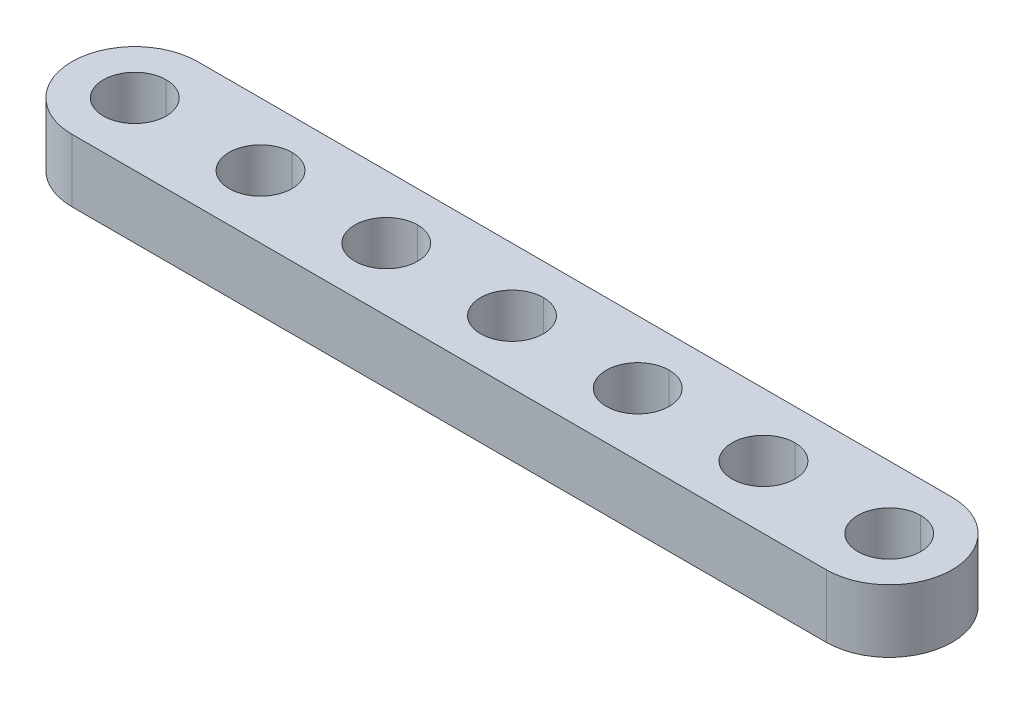
ISO-10303-21;
HEADER;
FILE_DESCRIPTION(('STEP AP214'),'2;1');
FILE_NAME('part.step','',(''),(''),'','','');
FILE_SCHEMA(('AUTOMOTIVE_DESIGN { 1 0 10303 214 1 1 1 1 }'));
ENDSEC;
DATA;
#1=APPLICATION_CONTEXT('core data for automotive mechanical design processes');
#2=APPLICATION_PROTOCOL_DEFINITION('international standard','automotive_design',2000,#1);
#3=PRODUCT_CONTEXT('',#1,'mechanical');
#4=PRODUCT('Part','Part','',(#3));
#5=PRODUCT_RELATED_PRODUCT_CATEGORY('part','',(#4));
#6=PRODUCT_DEFINITION_FORMATION('','',#4);
#7=PRODUCT_DEFINITION_CONTEXT('part definition',#1,'design');
#8=PRODUCT_DEFINITION('design','',#6,#7);
#9=PRODUCT_DEFINITION_SHAPE('','',#8);
#10=(LENGTH_UNIT() NAMED_UNIT(*) SI_UNIT(.MILLI.,.METRE.));
#11=(NAMED_UNIT(*) PLANE_ANGLE_UNIT() SI_UNIT($,.RADIAN.));
#12=(NAMED_UNIT(*) SI_UNIT($,.STERADIAN.) SOLID_ANGLE_UNIT());
#13=UNCERTAINTY_MEASURE_WITH_UNIT(LENGTH_MEASURE(1.E-05),#10,'distance_accuracy_value','');
#14=(GEOMETRIC_REPRESENTATION_CONTEXT(3) GLOBAL_UNCERTAINTY_ASSIGNED_CONTEXT((#13)) GLOBAL_UNIT_ASSIGNED_CONTEXT((#10,
#11,#12)) REPRESENTATION_CONTEXT('',''));
#15=CARTESIAN_POINT('',(0.,0.,0.));
#16=DIRECTION('',(0.,0.,1.));
#17=DIRECTION('',(1.,0.,0.));
#18=AXIS2_PLACEMENT_3D('',#15,#16,#17);
#19=CARTESIAN_POINT('',(24.,4.,0.));
#20=DIRECTION('',(0.,1.,0.));
#21=DIRECTION('',(0.,0.,1.));
#22=AXIS2_PLACEMENT_3D('',#19,#20,#21);
#23=CYLINDRICAL_SURFACE('',#22,2.);
#24=DIRECTION('',(0.,1.,0.));
#25=VECTOR('',#24,1.);
#26=CARTESIAN_POINT('',(24.,4.,-2.));
#27=LINE('',#26,#25);
#28=CARTESIAN_POINT('',(24.,0.,-2.));
#29=VERTEX_POINT('',#28);
#30=CARTESIAN_POINT('',(24.,4.,-2.));
#31=VERTEX_POINT('',#30);
#32=EDGE_CURVE('E207',#29,#31,#27,.T.);
#33=ORIENTED_EDGE('',*,*,#32,.F.);
#34=CARTESIAN_POINT('',(24.,0.,0.));
#35=DIRECTION('',(0.,1.,0.));
#36=DIRECTION('',(0.,0.,1.));
#37=AXIS2_PLACEMENT_3D('',#34,#35,#36);
#38=CIRCLE('',#37,2.);
#39=CARTESIAN_POINT('',(24.,0.,2.));
#40=VERTEX_POINT('',#39);
#41=EDGE_CURVE('E344',#40,#29,#38,.T.);
#42=ORIENTED_EDGE('',*,*,#41,.F.);
#43=DIRECTION('',(0.,1.,0.));
#44=VECTOR('',#43,1.);
#45=CARTESIAN_POINT('',(24.,4.,2.));
#46=LINE('',#45,#44);
#47=CARTESIAN_POINT('',(24.,4.,2.));
#48=VERTEX_POINT('',#47);
#49=EDGE_CURVE('E223',#40,#48,#46,.T.);
#50=ORIENTED_EDGE('',*,*,#49,.T.);
#51=CARTESIAN_POINT('',(24.,4.,0.));
#52=DIRECTION('',(0.,1.,0.));
#53=DIRECTION('',(0.,0.,1.));
#54=AXIS2_PLACEMENT_3D('',#51,#52,#53);
#55=CIRCLE('',#54,2.);
#56=EDGE_CURVE('E182',#48,#31,#55,.T.);
#57=ORIENTED_EDGE('',*,*,#56,.T.);
#58=EDGE_LOOP('',(#33,#42,#50,#57));
#59=FACE_BOUND('',#58,.T.);
#60=ADVANCED_FACE('F14',(#59),#23,.F.);
#61=CARTESIAN_POINT('',(16.,4.,0.));
#62=DIRECTION('',(0.,1.,0.));
#63=DIRECTION('',(0.,0.,1.));
#64=AXIS2_PLACEMENT_3D('',#61,#62,#63);
#65=CYLINDRICAL_SURFACE('',#64,2.);
#66=DIRECTION('',(0.,1.,0.));
#67=VECTOR('',#66,1.);
#68=CARTESIAN_POINT('',(16.,4.,-2.));
#69=LINE('',#68,#67);
#70=CARTESIAN_POINT('',(16.,0.,-2.));
#71=VERTEX_POINT('',#70);
#72=CARTESIAN_POINT('',(16.,4.,-2.));
#73=VERTEX_POINT('',#72);
#74=EDGE_CURVE('E195',#71,#73,#69,.T.);
#75=ORIENTED_EDGE('',*,*,#74,.F.);
#76=CARTESIAN_POINT('',(16.,0.,0.));
#77=DIRECTION('',(0.,1.,0.));
#78=DIRECTION('',(0.,0.,1.));
#79=AXIS2_PLACEMENT_3D('',#76,#77,#78);
#80=CIRCLE('',#79,2.);
#81=CARTESIAN_POINT('',(16.,0.,2.));
#82=VERTEX_POINT('',#81);
#83=EDGE_CURVE('E187',#82,#71,#80,.T.);
#84=ORIENTED_EDGE('',*,*,#83,.F.);
#85=DIRECTION('',(0.,1.,0.));
#86=VECTOR('',#85,1.);
#87=CARTESIAN_POINT('',(16.,4.,2.));
#88=LINE('',#87,#86);
#89=CARTESIAN_POINT('',(16.,4.,2.));
#90=VERTEX_POINT('',#89);
#91=EDGE_CURVE('E185',#82,#90,#88,.T.);
#92=ORIENTED_EDGE('',*,*,#91,.T.);
#93=CARTESIAN_POINT('',(16.,4.,0.));
#94=DIRECTION('',(0.,1.,0.));
#95=DIRECTION('',(0.,0.,1.));
#96=AXIS2_PLACEMENT_3D('',#93,#94,#95);
#97=CIRCLE('',#96,2.);
#98=EDGE_CURVE('E171',#90,#73,#97,.T.);
#99=ORIENTED_EDGE('',*,*,#98,.T.);
#100=EDGE_LOOP('',(#75,#84,#92,#99));
#101=FACE_BOUND('',#100,.T.);
#102=ADVANCED_FACE('F186',(#101),#65,.F.);
#103=CARTESIAN_POINT('',(8.,4.,0.));
#104=DIRECTION('',(0.,1.,0.));
#105=DIRECTION('',(0.,0.,1.));
#106=AXIS2_PLACEMENT_3D('',#103,#104,#105);
#107=CYLINDRICAL_SURFACE('',#106,2.);
#108=DIRECTION('',(0.,1.,0.));
#109=VECTOR('',#108,1.);
#110=CARTESIAN_POINT('',(8.,4.,-2.));
#111=LINE('',#110,#109);
#112=CARTESIAN_POINT('',(8.,0.,-2.));
#113=VERTEX_POINT('',#112);
#114=CARTESIAN_POINT('',(8.,4.,-2.));
#115=VERTEX_POINT('',#114);
#116=EDGE_CURVE('E211',#113,#115,#111,.T.);
#117=ORIENTED_EDGE('',*,*,#116,.F.);
#118=CARTESIAN_POINT('',(8.,0.,0.));
#119=DIRECTION('',(0.,1.,0.));
#120=DIRECTION('',(0.,0.,1.));
#121=AXIS2_PLACEMENT_3D('',#118,#119,#120);
#122=CIRCLE('',#121,2.);
#123=CARTESIAN_POINT('',(8.,0.,2.));
#124=VERTEX_POINT('',#123);
#125=EDGE_CURVE('E215',#124,#113,#122,.T.);
#126=ORIENTED_EDGE('',*,*,#125,.F.);
#127=DIRECTION('',(0.,1.,0.));
#128=VECTOR('',#127,1.);
#129=CARTESIAN_POINT('',(8.,4.,2.));
#130=LINE('',#129,#128);
#131=CARTESIAN_POINT('',(8.,4.,2.));
#132=VERTEX_POINT('',#131);
#133=EDGE_CURVE('E302',#124,#132,#130,.T.);
#134=ORIENTED_EDGE('',*,*,#133,.T.);
#135=CARTESIAN_POINT('',(8.,4.,0.));
#136=DIRECTION('',(0.,1.,0.));
#137=DIRECTION('',(0.,0.,1.));
#138=AXIS2_PLACEMENT_3D('',#135,#136,#137);
#139=CIRCLE('',#138,2.);
#140=EDGE_CURVE('E181',#132,#115,#139,.T.);
#141=ORIENTED_EDGE('',*,*,#140,.T.);
#142=EDGE_LOOP('',(#117,#126,#134,#141));
#143=FACE_BOUND('',#142,.T.);
#144=ADVANCED_FACE('F463',(#143),#107,.F.);
#145=CARTESIAN_POINT('',(0.,4.,0.));
#146=DIRECTION('',(0.,1.,0.));
#147=DIRECTION('',(0.,0.,1.));
#148=AXIS2_PLACEMENT_3D('',#145,#146,#147);
#149=CYLINDRICAL_SURFACE('',#148,2.);
#150=DIRECTION('',(0.,1.,0.));
#151=VECTOR('',#150,1.);
#152=CARTESIAN_POINT('',(0.,4.,-2.));
#153=LINE('',#152,#151);
#154=CARTESIAN_POINT('',(0.,0.,-2.));
#155=VERTEX_POINT('',#154);
#156=CARTESIAN_POINT('',(0.,4.,-2.));
#157=VERTEX_POINT('',#156);
#158=EDGE_CURVE('E411',#155,#157,#153,.T.);
#159=ORIENTED_EDGE('',*,*,#158,.F.);
#160=CARTESIAN_POINT('',(0.,0.,0.));
#161=DIRECTION('',(0.,1.,0.));
#162=DIRECTION('',(0.,0.,1.));
#163=AXIS2_PLACEMENT_3D('',#160,#161,#162);
#164=CIRCLE('',#163,2.);
#165=CARTESIAN_POINT('',(0.,0.,2.));
#166=VERTEX_POINT('',#165);
#167=EDGE_CURVE('E217',#166,#155,#164,.T.);
#168=ORIENTED_EDGE('',*,*,#167,.F.);
#169=DIRECTION('',(0.,1.,0.));
#170=VECTOR('',#169,1.);
#171=CARTESIAN_POINT('',(0.,4.,2.));
#172=LINE('',#171,#170);
#173=CARTESIAN_POINT('',(0.,4.,2.));
#174=VERTEX_POINT('',#173);
#175=EDGE_CURVE('E265',#166,#174,#172,.T.);
#176=ORIENTED_EDGE('',*,*,#175,.T.);
#177=CARTESIAN_POINT('',(0.,4.,0.));
#178=DIRECTION('',(0.,1.,0.));
#179=DIRECTION('',(0.,0.,1.));
#180=AXIS2_PLACEMENT_3D('',#177,#178,#179);
#181=CIRCLE('',#180,2.);
#182=EDGE_CURVE('E342',#174,#157,#181,.T.);
#183=ORIENTED_EDGE('',*,*,#182,.T.);
#184=EDGE_LOOP('',(#159,#168,#176,#183));
#185=FACE_BOUND('',#184,.T.);
#186=ADVANCED_FACE('F446',(#185),#149,.F.);
#187=CARTESIAN_POINT('',(-8.,4.,0.));
#188=DIRECTION('',(0.,1.,0.));
#189=DIRECTION('',(0.,0.,1.));
#190=AXIS2_PLACEMENT_3D('',#187,#188,#189);
#191=CYLINDRICAL_SURFACE('',#190,2.);
#192=DIRECTION('',(0.,1.,0.));
#193=VECTOR('',#192,1.);
#194=CARTESIAN_POINT('',(-8.,4.,-2.));
#195=LINE('',#194,#193);
#196=CARTESIAN_POINT('',(-8.,0.,-2.));
#197=VERTEX_POINT('',#196);
#198=CARTESIAN_POINT('',(-8.,4.,-2.));
#199=VERTEX_POINT('',#198);
#200=EDGE_CURVE('E243',#197,#199,#195,.T.);
#201=ORIENTED_EDGE('',*,*,#200,.F.);
#202=CARTESIAN_POINT('',(-8.,0.,0.));
#203=DIRECTION('',(0.,1.,0.));
#204=DIRECTION('',(0.,0.,1.));
#205=AXIS2_PLACEMENT_3D('',#202,#203,#204);
#206=CIRCLE('',#205,2.);
#207=CARTESIAN_POINT('',(-8.,0.,2.));
#208=VERTEX_POINT('',#207);
#209=EDGE_CURVE('E225',#208,#197,#206,.T.);
#210=ORIENTED_EDGE('',*,*,#209,.F.);
#211=DIRECTION('',(0.,1.,0.));
#212=VECTOR('',#211,1.);
#213=CARTESIAN_POINT('',(-8.,4.,2.));
#214=LINE('',#213,#212);
#215=CARTESIAN_POINT('',(-8.,4.,2.));
#216=VERTEX_POINT('',#215);
#217=EDGE_CURVE('E226',#208,#216,#214,.T.);
#218=ORIENTED_EDGE('',*,*,#217,.T.);
#219=CARTESIAN_POINT('',(-8.,4.,0.));
#220=DIRECTION('',(0.,1.,0.));
#221=DIRECTION('',(0.,0.,1.));
#222=AXIS2_PLACEMENT_3D('',#219,#220,#221);
#223=CIRCLE('',#222,2.);
#224=EDGE_CURVE('E723',#216,#199,#223,.T.);
#225=ORIENTED_EDGE('',*,*,#224,.T.);
#226=EDGE_LOOP('',(#201,#210,#218,#225));
#227=FACE_BOUND('',#226,.T.);
#228=ADVANCED_FACE('F441',(#227),#191,.F.);
#229=CARTESIAN_POINT('',(-16.,4.,0.));
#230=DIRECTION('',(0.,1.,0.));
#231=DIRECTION('',(0.,0.,1.));
#232=AXIS2_PLACEMENT_3D('',#229,#230,#231);
#233=CYLINDRICAL_SURFACE('',#232,2.);
#234=DIRECTION('',(0.,1.,0.));
#235=VECTOR('',#234,1.);
#236=CARTESIAN_POINT('',(-16.,4.,-2.));
#237=LINE('',#236,#235);
#238=CARTESIAN_POINT('',(-16.,0.,-2.));
#239=VERTEX_POINT('',#238);
#240=CARTESIAN_POINT('',(-16.,4.,-2.));
#241=VERTEX_POINT('',#240);
#242=EDGE_CURVE('E240',#239,#241,#237,.T.);
#243=ORIENTED_EDGE('',*,*,#242,.F.);
#244=CARTESIAN_POINT('',(-16.,0.,0.));
#245=DIRECTION('',(0.,1.,0.));
#246=DIRECTION('',(0.,0.,1.));
#247=AXIS2_PLACEMENT_3D('',#244,#245,#246);
#248=CIRCLE('',#247,2.);
#249=CARTESIAN_POINT('',(-16.,0.,2.));
#250=VERTEX_POINT('',#249);
#251=EDGE_CURVE('E24',#250,#239,#248,.T.);
#252=ORIENTED_EDGE('',*,*,#251,.F.);
#253=DIRECTION('',(0.,1.,0.));
#254=VECTOR('',#253,1.);
#255=CARTESIAN_POINT('',(-16.,4.,2.));
#256=LINE('',#255,#254);
#257=CARTESIAN_POINT('',(-16.,4.,2.));
#258=VERTEX_POINT('',#257);
#259=EDGE_CURVE('E269',#250,#258,#256,.T.);
#260=ORIENTED_EDGE('',*,*,#259,.T.);
#261=CARTESIAN_POINT('',(-16.,4.,0.));
#262=DIRECTION('',(0.,1.,0.));
#263=DIRECTION('',(0.,0.,1.));
#264=AXIS2_PLACEMENT_3D('',#261,#262,#263);
#265=CIRCLE('',#264,2.);
#266=EDGE_CURVE('E128',#258,#241,#265,.T.);
#267=ORIENTED_EDGE('',*,*,#266,.T.);
#268=EDGE_LOOP('',(#243,#252,#260,#267));
#269=FACE_BOUND('',#268,.T.);
#270=ADVANCED_FACE('F445',(#269),#233,.F.);
#271=CARTESIAN_POINT('',(-24.,4.,0.));
#272=DIRECTION('',(0.,1.,0.));
#273=DIRECTION('',(0.,0.,1.));
#274=AXIS2_PLACEMENT_3D('',#271,#272,#273);
#275=CYLINDRICAL_SURFACE('',#274,2.);
#276=DIRECTION('',(0.,1.,0.));
#277=VECTOR('',#276,1.);
#278=CARTESIAN_POINT('',(-24.,4.,-2.));
#279=LINE('',#278,#277);
#280=CARTESIAN_POINT('',(-24.,0.,-2.));
#281=VERTEX_POINT('',#280);
#282=CARTESIAN_POINT('',(-24.,4.,-2.));
#283=VERTEX_POINT('',#282);
#284=EDGE_CURVE('E293',#281,#283,#279,.T.);
#285=ORIENTED_EDGE('',*,*,#284,.F.);
#286=CARTESIAN_POINT('',(-24.,0.,0.));
#287=DIRECTION('',(0.,1.,0.));
#288=DIRECTION('',(0.,0.,1.));
#289=AXIS2_PLACEMENT_3D('',#286,#287,#288);
#290=CIRCLE('',#289,2.);
#291=CARTESIAN_POINT('',(-24.,0.,2.));
#292=VERTEX_POINT('',#291);
#293=EDGE_CURVE('E9',#292,#281,#290,.T.);
#294=ORIENTED_EDGE('',*,*,#293,.F.);
#295=DIRECTION('',(0.,1.,0.));
#296=VECTOR('',#295,1.);
#297=CARTESIAN_POINT('',(-24.,4.,2.));
#298=LINE('',#297,#296);
#299=CARTESIAN_POINT('',(-24.,4.,2.));
#300=VERTEX_POINT('',#299);
#301=EDGE_CURVE('E307',#292,#300,#298,.T.);
#302=ORIENTED_EDGE('',*,*,#301,.T.);
#303=CARTESIAN_POINT('',(-24.,4.,0.));
#304=DIRECTION('',(0.,1.,0.));
#305=DIRECTION('',(0.,0.,1.));
#306=AXIS2_PLACEMENT_3D('',#303,#304,#305);
#307=CIRCLE('',#306,2.);
#308=EDGE_CURVE('E741',#300,#283,#307,.T.);
#309=ORIENTED_EDGE('',*,*,#308,.T.);
#310=EDGE_LOOP('',(#285,#294,#302,#309));
#311=FACE_BOUND('',#310,.T.);
#312=ADVANCED_FACE('F451',(#311),#275,.F.);
#313=CARTESIAN_POINT('',(-24.,0.,0.));
#314=DIRECTION('',(0.,1.,0.));
#315=DIRECTION('',(1.,0.,0.));
#316=AXIS2_PLACEMENT_3D('',#313,#314,#315);
#317=PLANE('',#316);
#318=ORIENTED_EDGE('',*,*,#293,.T.);
#319=CARTESIAN_POINT('',(-24.,0.,0.));
#320=DIRECTION('',(0.,1.,0.));
#321=DIRECTION('',(0.,0.,1.));
#322=AXIS2_PLACEMENT_3D('',#319,#320,#321);
#323=CIRCLE('',#322,2.);
#324=EDGE_CURVE('E276',#281,#292,#323,.T.);
#325=ORIENTED_EDGE('',*,*,#324,.T.);
#326=EDGE_LOOP('',(#318,#325));
#327=FACE_BOUND('',#326,.T.);
#328=ORIENTED_EDGE('',*,*,#251,.T.);
#329=CARTESIAN_POINT('',(-16.,0.,0.));
#330=DIRECTION('',(0.,1.,0.));
#331=DIRECTION('',(0.,0.,1.));
#332=AXIS2_PLACEMENT_3D('',#329,#330,#331);
#333=CIRCLE('',#332,2.);
#334=EDGE_CURVE('E229',#239,#250,#333,.T.);
#335=ORIENTED_EDGE('',*,*,#334,.T.);
#336=EDGE_LOOP('',(#328,#335));
#337=FACE_BOUND('',#336,.T.);
#338=ORIENTED_EDGE('',*,*,#209,.T.);
#339=CARTESIAN_POINT('',(-8.,0.,0.));
#340=DIRECTION('',(0.,1.,0.));
#341=DIRECTION('',(0.,0.,1.));
#342=AXIS2_PLACEMENT_3D('',#339,#340,#341);
#343=CIRCLE('',#342,2.);
#344=EDGE_CURVE('E253',#197,#208,#343,.T.);
#345=ORIENTED_EDGE('',*,*,#344,.T.);
#346=EDGE_LOOP('',(#338,#345));
#347=FACE_BOUND('',#346,.T.);
#348=ORIENTED_EDGE('',*,*,#167,.T.);
#349=CARTESIAN_POINT('',(0.,0.,0.));
#350=DIRECTION('',(0.,1.,0.));
#351=DIRECTION('',(0.,0.,1.));
#352=AXIS2_PLACEMENT_3D('',#349,#350,#351);
#353=CIRCLE('',#352,2.);
#354=EDGE_CURVE('E287',#155,#166,#353,.T.);
#355=ORIENTED_EDGE('',*,*,#354,.T.);
#356=EDGE_LOOP('',(#348,#355));
#357=FACE_BOUND('',#356,.T.);
#358=ORIENTED_EDGE('',*,*,#125,.T.);
#359=CARTESIAN_POINT('',(8.,0.,0.));
#360=DIRECTION('',(0.,1.,0.));
#361=DIRECTION('',(0.,0.,1.));
#362=AXIS2_PLACEMENT_3D('',#359,#360,#361);
#363=CIRCLE('',#362,2.);
#364=EDGE_CURVE('E192',#113,#124,#363,.T.);
#365=ORIENTED_EDGE('',*,*,#364,.T.);
#366=EDGE_LOOP('',(#358,#365));
#367=FACE_BOUND('',#366,.T.);
#368=ORIENTED_EDGE('',*,*,#83,.T.);
#369=CARTESIAN_POINT('',(16.,0.,0.));
#370=DIRECTION('',(0.,1.,0.));
#371=DIRECTION('',(0.,0.,1.));
#372=AXIS2_PLACEMENT_3D('',#369,#370,#371);
#373=CIRCLE('',#372,2.);
#374=EDGE_CURVE('E203',#71,#82,#373,.T.);
#375=ORIENTED_EDGE('',*,*,#374,.T.);
#376=EDGE_LOOP('',(#368,#375));
#377=FACE_BOUND('',#376,.T.);
#378=ORIENTED_EDGE('',*,*,#41,.T.);
#379=CARTESIAN_POINT('',(24.,0.,0.));
#380=DIRECTION('',(0.,1.,0.));
#381=DIRECTION('',(0.,0.,1.));
#382=AXIS2_PLACEMENT_3D('',#379,#380,#381);
#383=CIRCLE('',#382,2.);
#384=EDGE_CURVE('E321',#29,#40,#383,.T.);
#385=ORIENTED_EDGE('',*,*,#384,.T.);
#386=EDGE_LOOP('',(#378,#385));
#387=FACE_BOUND('',#386,.T.);
#388=CARTESIAN_POINT('',(-24.,0.,0.));
#389=DIRECTION('',(0.,1.,0.));
#390=DIRECTION('',(0.,0.,1.));
#391=AXIS2_PLACEMENT_3D('',#388,#389,#390);
#392=CIRCLE('',#391,4.);
#393=CARTESIAN_POINT('',(-24.,0.,-4.));
#394=VERTEX_POINT('',#393);
#395=CARTESIAN_POINT('',(-24.,0.,4.));
#396=VERTEX_POINT('',#395);
#397=EDGE_CURVE('E311',#394,#396,#392,.T.);
#398=ORIENTED_EDGE('',*,*,#397,.F.);
#399=DIRECTION('',(-1.,0.,0.));
#400=VECTOR('',#399,1.);
#401=CARTESIAN_POINT('',(-24.,0.,-4.));
#402=LINE('',#401,#400);
#403=CARTESIAN_POINT('',(24.,0.,-4.));
#404=VERTEX_POINT('',#403);
#405=EDGE_CURVE('E52',#404,#394,#402,.T.);
#406=ORIENTED_EDGE('',*,*,#405,.F.);
#407=CARTESIAN_POINT('',(24.,0.,0.));
#408=DIRECTION('',(0.,1.,0.));
#409=DIRECTION('',(0.,0.,1.));
#410=AXIS2_PLACEMENT_3D('',#407,#408,#409);
#411=CIRCLE('',#410,4.);
#412=CARTESIAN_POINT('',(24.,0.,4.));
#413=VERTEX_POINT('',#412);
#414=EDGE_CURVE('E329',#413,#404,#411,.T.);
#415=ORIENTED_EDGE('',*,*,#414,.F.);
#416=DIRECTION('',(1.,0.,0.));
#417=VECTOR('',#416,1.);
#418=CARTESIAN_POINT('',(-24.,0.,4.));
#419=LINE('',#418,#417);
#420=EDGE_CURVE('E297',#396,#413,#419,.T.);
#421=ORIENTED_EDGE('',*,*,#420,.F.);
#422=EDGE_LOOP('',(#398,#406,#415,#421));
#423=FACE_BOUND('',#422,.T.);
#424=ADVANCED_FACE('F354',(#327,#337,#347,#357,#367,#377,#387,#423),#317,.F.);
#425=CARTESIAN_POINT('',(-24.,4.,0.));
#426=DIRECTION('',(0.,1.,0.));
#427=DIRECTION('',(1.,0.,0.));
#428=AXIS2_PLACEMENT_3D('',#425,#426,#427);
#429=PLANE('',#428);
#430=ORIENTED_EDGE('',*,*,#308,.F.);
#431=CARTESIAN_POINT('',(-24.,4.,0.));
#432=DIRECTION('',(0.,1.,0.));
#433=DIRECTION('',(0.,0.,1.));
#434=AXIS2_PLACEMENT_3D('',#431,#432,#433);
#435=CIRCLE('',#434,2.);
#436=EDGE_CURVE('E312',#283,#300,#435,.T.);
#437=ORIENTED_EDGE('',*,*,#436,.F.);
#438=EDGE_LOOP('',(#430,#437));
#439=FACE_BOUND('',#438,.T.);
#440=ORIENTED_EDGE('',*,*,#266,.F.);
#441=CARTESIAN_POINT('',(-16.,4.,0.));
#442=DIRECTION('',(0.,1.,0.));
#443=DIRECTION('',(0.,0.,1.));
#444=AXIS2_PLACEMENT_3D('',#441,#442,#443);
#445=CIRCLE('',#444,2.);
#446=EDGE_CURVE('E266',#241,#258,#445,.T.);
#447=ORIENTED_EDGE('',*,*,#446,.F.);
#448=EDGE_LOOP('',(#440,#447));
#449=FACE_BOUND('',#448,.T.);
#450=ORIENTED_EDGE('',*,*,#224,.F.);
#451=CARTESIAN_POINT('',(-8.,4.,0.));
#452=DIRECTION('',(0.,1.,0.));
#453=DIRECTION('',(0.,0.,1.));
#454=AXIS2_PLACEMENT_3D('',#451,#452,#453);
#455=CIRCLE('',#454,2.);
#456=EDGE_CURVE('E230',#199,#216,#455,.T.);
#457=ORIENTED_EDGE('',*,*,#456,.F.);
#458=EDGE_LOOP('',(#450,#457));
#459=FACE_BOUND('',#458,.T.);
#460=ORIENTED_EDGE('',*,*,#182,.F.);
#461=CARTESIAN_POINT('',(0.,4.,0.));
#462=DIRECTION('',(0.,1.,0.));
#463=DIRECTION('',(0.,0.,1.));
#464=AXIS2_PLACEMENT_3D('',#461,#462,#463);
#465=CIRCLE('',#464,2.);
#466=EDGE_CURVE('E18',#157,#174,#465,.T.);
#467=ORIENTED_EDGE('',*,*,#466,.F.);
#468=EDGE_LOOP('',(#460,#467));
#469=FACE_BOUND('',#468,.T.);
#470=ORIENTED_EDGE('',*,*,#140,.F.);
#471=CARTESIAN_POINT('',(8.,4.,0.));
#472=DIRECTION('',(0.,1.,0.));
#473=DIRECTION('',(0.,0.,1.));
#474=AXIS2_PLACEMENT_3D('',#471,#472,#473);
#475=CIRCLE('',#474,2.);
#476=EDGE_CURVE('E305',#115,#132,#475,.T.);
#477=ORIENTED_EDGE('',*,*,#476,.F.);
#478=EDGE_LOOP('',(#470,#477));
#479=FACE_BOUND('',#478,.T.);
#480=ORIENTED_EDGE('',*,*,#98,.F.);
#481=CARTESIAN_POINT('',(16.,4.,0.));
#482=DIRECTION('',(0.,1.,0.));
#483=DIRECTION('',(0.,0.,1.));
#484=AXIS2_PLACEMENT_3D('',#481,#482,#483);
#485=CIRCLE('',#484,2.);
#486=EDGE_CURVE('E176',#73,#90,#485,.T.);
#487=ORIENTED_EDGE('',*,*,#486,.F.);
#488=EDGE_LOOP('',(#480,#487));
#489=FACE_BOUND('',#488,.T.);
#490=ORIENTED_EDGE('',*,*,#56,.F.);
#491=CARTESIAN_POINT('',(24.,4.,0.));
#492=DIRECTION('',(0.,1.,0.));
#493=DIRECTION('',(0.,0.,1.));
#494=AXIS2_PLACEMENT_3D('',#491,#492,#493);
#495=CIRCLE('',#494,2.);
#496=EDGE_CURVE('E219',#31,#48,#495,.T.);
#497=ORIENTED_EDGE('',*,*,#496,.F.);
#498=EDGE_LOOP('',(#490,#497));
#499=FACE_BOUND('',#498,.T.);
#500=CARTESIAN_POINT('',(-24.,4.,0.));
#501=DIRECTION('',(0.,1.,0.));
#502=DIRECTION('',(0.,0.,1.));
#503=AXIS2_PLACEMENT_3D('',#500,#501,#502);
#504=CIRCLE('',#503,4.);
#505=CARTESIAN_POINT('',(-24.,4.,-4.));
#506=VERTEX_POINT('',#505);
#507=CARTESIAN_POINT('',(-24.,4.,4.));
#508=VERTEX_POINT('',#507);
#509=EDGE_CURVE('E259',#506,#508,#504,.T.);
#510=ORIENTED_EDGE('',*,*,#509,.T.);
#511=DIRECTION('',(1.,0.,0.));
#512=VECTOR('',#511,1.);
#513=CARTESIAN_POINT('',(-24.,4.,4.));
#514=LINE('',#513,#512);
#515=CARTESIAN_POINT('',(24.,4.,4.));
#516=VERTEX_POINT('',#515);
#517=EDGE_CURVE('E325',#508,#516,#514,.T.);
#518=ORIENTED_EDGE('',*,*,#517,.T.);
#519=CARTESIAN_POINT('',(24.,4.,0.));
#520=DIRECTION('',(0.,1.,0.));
#521=DIRECTION('',(0.,0.,1.));
#522=AXIS2_PLACEMENT_3D('',#519,#520,#521);
#523=CIRCLE('',#522,4.);
#524=CARTESIAN_POINT('',(24.,4.,-4.));
#525=VERTEX_POINT('',#524);
#526=EDGE_CURVE('E214',#516,#525,#523,.T.);
#527=ORIENTED_EDGE('',*,*,#526,.T.);
#528=DIRECTION('',(-1.,0.,0.));
#529=VECTOR('',#528,1.);
#530=CARTESIAN_POINT('',(-24.,4.,-4.));
#531=LINE('',#530,#529);
#532=EDGE_CURVE('E38',#525,#506,#531,.T.);
#533=ORIENTED_EDGE('',*,*,#532,.T.);
#534=EDGE_LOOP('',(#510,#518,#527,#533));
#535=FACE_BOUND('',#534,.T.);
#536=ADVANCED_FACE('F173',(#439,#449,#459,#469,#479,#489,#499,#535),#429,.T.);
#537=CARTESIAN_POINT('',(-24.,4.,-4.));
#538=DIRECTION('',(0.,0.,1.));
#539=DIRECTION('',(1.,0.,0.));
#540=AXIS2_PLACEMENT_3D('',#537,#538,#539);
#541=PLANE('',#540);
#542=ORIENTED_EDGE('',*,*,#405,.T.);
#543=DIRECTION('',(0.,-1.,0.));
#544=VECTOR('',#543,1.);
#545=CARTESIAN_POINT('',(-24.,4.,-4.));
#546=LINE('',#545,#544);
#547=EDGE_CURVE('E257',#506,#394,#546,.T.);
#548=ORIENTED_EDGE('',*,*,#547,.F.);
#549=ORIENTED_EDGE('',*,*,#532,.F.);
#550=DIRECTION('',(0.,-1.,0.));
#551=VECTOR('',#550,1.);
#552=CARTESIAN_POINT('',(24.,4.,-4.));
#553=LINE('',#552,#551);
#554=EDGE_CURVE('E315',#525,#404,#553,.T.);
#555=ORIENTED_EDGE('',*,*,#554,.T.);
#556=EDGE_LOOP('',(#542,#548,#549,#555));
#557=FACE_BOUND('',#556,.T.);
#558=ADVANCED_FACE('F364',(#557),#541,.F.);
#559=CARTESIAN_POINT('',(24.,4.,0.));
#560=DIRECTION('',(0.,-1.,0.));
#561=DIRECTION('',(0.,0.,-1.));
#562=AXIS2_PLACEMENT_3D('',#559,#560,#561);
#563=CYLINDRICAL_SURFACE('',#562,4.);
#564=ORIENTED_EDGE('',*,*,#414,.T.);
#565=ORIENTED_EDGE('',*,*,#554,.F.);
#566=ORIENTED_EDGE('',*,*,#526,.F.);
#567=DIRECTION('',(0.,-1.,0.));
#568=VECTOR('',#567,1.);
#569=CARTESIAN_POINT('',(24.,4.,4.));
#570=LINE('',#569,#568);
#571=EDGE_CURVE('E300',#516,#413,#570,.T.);
#572=ORIENTED_EDGE('',*,*,#571,.T.);
#573=EDGE_LOOP('',(#564,#565,#566,#572));
#574=FACE_BOUND('',#573,.T.);
#575=ADVANCED_FACE('F16',(#574),#563,.T.);
#576=CARTESIAN_POINT('',(-24.,4.,4.));
#577=DIRECTION('',(0.,0.,-1.));
#578=DIRECTION('',(0.,-1.,0.));
#579=AXIS2_PLACEMENT_3D('',#576,#577,#578);
#580=PLANE('',#579);
#581=ORIENTED_EDGE('',*,*,#420,.T.);
#582=ORIENTED_EDGE('',*,*,#571,.F.);
#583=ORIENTED_EDGE('',*,*,#517,.F.);
#584=DIRECTION('',(0.,-1.,0.));
#585=VECTOR('',#584,1.);
#586=CARTESIAN_POINT('',(-24.,4.,4.));
#587=LINE('',#586,#585);
#588=EDGE_CURVE('E262',#508,#396,#587,.T.);
#589=ORIENTED_EDGE('',*,*,#588,.T.);
#590=EDGE_LOOP('',(#581,#582,#583,#589));
#591=FACE_BOUND('',#590,.T.);
#592=ADVANCED_FACE('F359',(#591),#580,.F.);
#593=CARTESIAN_POINT('',(-24.,4.,0.));
#594=DIRECTION('',(0.,-1.,0.));
#595=DIRECTION('',(0.,0.,-1.));
#596=AXIS2_PLACEMENT_3D('',#593,#594,#595);
#597=CYLINDRICAL_SURFACE('',#596,4.);
#598=ORIENTED_EDGE('',*,*,#397,.T.);
#599=ORIENTED_EDGE('',*,*,#588,.F.);
#600=ORIENTED_EDGE('',*,*,#509,.F.);
#601=ORIENTED_EDGE('',*,*,#547,.T.);
#602=EDGE_LOOP('',(#598,#599,#600,#601));
#603=FACE_BOUND('',#602,.T.);
#604=ADVANCED_FACE('F352',(#603),#597,.T.);
#605=CARTESIAN_POINT('',(-24.,4.,0.));
#606=DIRECTION('',(0.,1.,0.));
#607=DIRECTION('',(0.,0.,1.));
#608=AXIS2_PLACEMENT_3D('',#605,#606,#607);
#609=CYLINDRICAL_SURFACE('',#608,2.);
#610=ORIENTED_EDGE('',*,*,#324,.F.);
#611=ORIENTED_EDGE('',*,*,#284,.T.);
#612=ORIENTED_EDGE('',*,*,#436,.T.);
#613=ORIENTED_EDGE('',*,*,#301,.F.);
#614=EDGE_LOOP('',(#610,#611,#612,#613));
#615=FACE_BOUND('',#614,.T.);
#616=ADVANCED_FACE('F481',(#615),#609,.F.);
#617=CARTESIAN_POINT('',(-16.,4.,0.));
#618=DIRECTION('',(0.,1.,0.));
#619=DIRECTION('',(0.,0.,1.));
#620=AXIS2_PLACEMENT_3D('',#617,#618,#619);
#621=CYLINDRICAL_SURFACE('',#620,2.);
#622=ORIENTED_EDGE('',*,*,#334,.F.);
#623=ORIENTED_EDGE('',*,*,#242,.T.);
#624=ORIENTED_EDGE('',*,*,#446,.T.);
#625=ORIENTED_EDGE('',*,*,#259,.F.);
#626=EDGE_LOOP('',(#622,#623,#624,#625));
#627=FACE_BOUND('',#626,.T.);
#628=ADVANCED_FACE('F477',(#627),#621,.F.);
#629=CARTESIAN_POINT('',(-8.,4.,0.));
#630=DIRECTION('',(0.,1.,0.));
#631=DIRECTION('',(0.,0.,1.));
#632=AXIS2_PLACEMENT_3D('',#629,#630,#631);
#633=CYLINDRICAL_SURFACE('',#632,2.);
#634=ORIENTED_EDGE('',*,*,#344,.F.);
#635=ORIENTED_EDGE('',*,*,#200,.T.);
#636=ORIENTED_EDGE('',*,*,#456,.T.);
#637=ORIENTED_EDGE('',*,*,#217,.F.);
#638=EDGE_LOOP('',(#634,#635,#636,#637));
#639=FACE_BOUND('',#638,.T.);
#640=ADVANCED_FACE('F435',(#639),#633,.F.);
#641=CARTESIAN_POINT('',(0.,4.,0.));
#642=DIRECTION('',(0.,1.,0.));
#643=DIRECTION('',(0.,0.,1.));
#644=AXIS2_PLACEMENT_3D('',#641,#642,#643);
#645=CYLINDRICAL_SURFACE('',#644,2.);
#646=ORIENTED_EDGE('',*,*,#354,.F.);
#647=ORIENTED_EDGE('',*,*,#158,.T.);
#648=ORIENTED_EDGE('',*,*,#466,.T.);
#649=ORIENTED_EDGE('',*,*,#175,.F.);
#650=EDGE_LOOP('',(#646,#647,#648,#649));
#651=FACE_BOUND('',#650,.T.);
#652=ADVANCED_FACE('F431',(#651),#645,.F.);
#653=CARTESIAN_POINT('',(8.,4.,0.));
#654=DIRECTION('',(0.,1.,0.));
#655=DIRECTION('',(0.,0.,1.));
#656=AXIS2_PLACEMENT_3D('',#653,#654,#655);
#657=CYLINDRICAL_SURFACE('',#656,2.);
#658=ORIENTED_EDGE('',*,*,#364,.F.);
#659=ORIENTED_EDGE('',*,*,#116,.T.);
#660=ORIENTED_EDGE('',*,*,#476,.T.);
#661=ORIENTED_EDGE('',*,*,#133,.F.);
#662=EDGE_LOOP('',(#658,#659,#660,#661));
#663=FACE_BOUND('',#662,.T.);
#664=ADVANCED_FACE('F426',(#663),#657,.F.);
#665=CARTESIAN_POINT('',(16.,4.,0.));
#666=DIRECTION('',(0.,1.,0.));
#667=DIRECTION('',(0.,0.,1.));
#668=AXIS2_PLACEMENT_3D('',#665,#666,#667);
#669=CYLINDRICAL_SURFACE('',#668,2.);
#670=ORIENTED_EDGE('',*,*,#374,.F.);
#671=ORIENTED_EDGE('',*,*,#74,.T.);
#672=ORIENTED_EDGE('',*,*,#486,.T.);
#673=ORIENTED_EDGE('',*,*,#91,.F.);
#674=EDGE_LOOP('',(#670,#671,#672,#673));
#675=FACE_BOUND('',#674,.T.);
#676=ADVANCED_FACE('F194',(#675),#669,.F.);
#677=CARTESIAN_POINT('',(24.,4.,0.));
#678=DIRECTION('',(0.,1.,0.));
#679=DIRECTION('',(0.,0.,1.));
#680=AXIS2_PLACEMENT_3D('',#677,#678,#679);
#681=CYLINDRICAL_SURFACE('',#680,2.);
#682=ORIENTED_EDGE('',*,*,#384,.F.);
#683=ORIENTED_EDGE('',*,*,#32,.T.);
#684=ORIENTED_EDGE('',*,*,#496,.T.);
#685=ORIENTED_EDGE('',*,*,#49,.F.);
#686=EDGE_LOOP('',(#682,#683,#684,#685));
#687=FACE_BOUND('',#686,.T.);
#688=ADVANCED_FACE('F425',(#687),#681,.F.);
#689=CLOSED_SHELL('',(#60,#102,#144,#186,#228,#270,#312,#424,#536,#558,#575,#592,#604,#616,#628,
#640,#652,#664,#676,#688));
#690=MANIFOLD_SOLID_BREP('B1',#689);
#691=ADVANCED_BREP_SHAPE_REPRESENTATION('',(#18,#690),#14);
#692=SHAPE_DEFINITION_REPRESENTATION(#9,#691);
ENDSEC;
END-ISO-10303-21;
